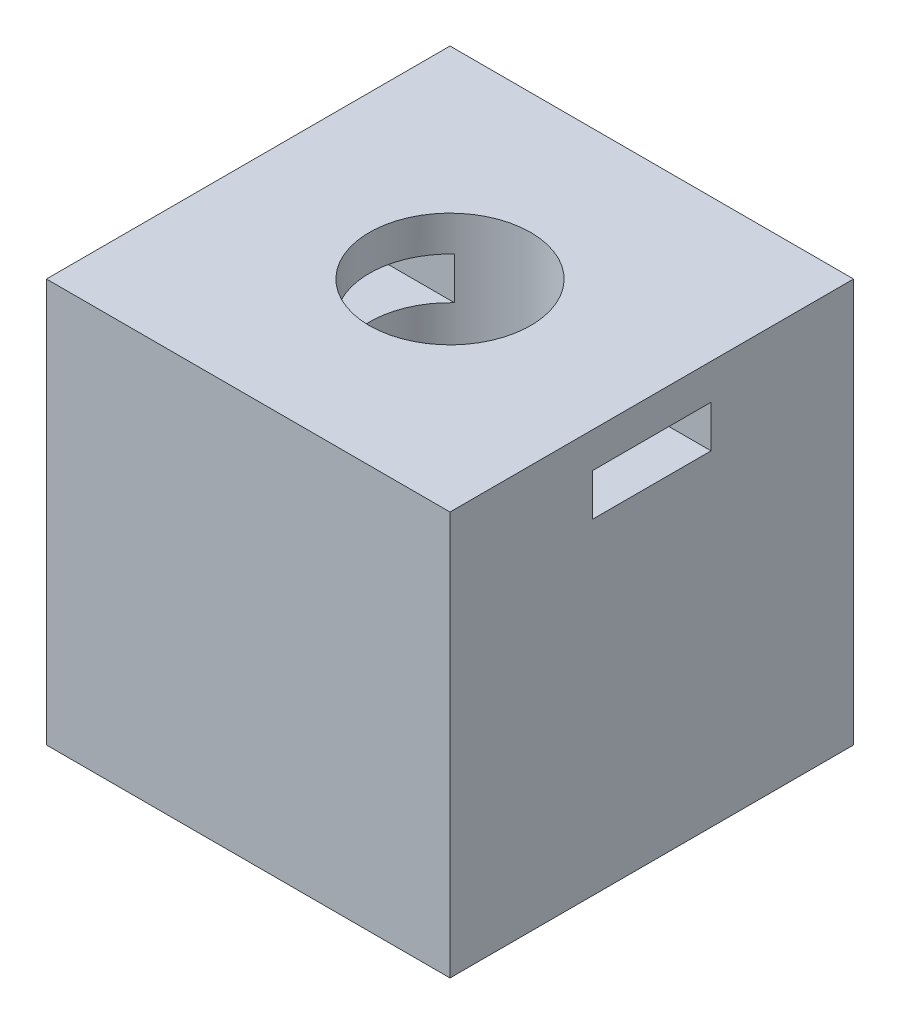
ISO-10303-21;
HEADER;
FILE_DESCRIPTION(('STEP AP214'),'2;1');
FILE_NAME('part.step','',(''),(''),'','','');
FILE_SCHEMA(('AUTOMOTIVE_DESIGN { 1 0 10303 214 1 1 1 1 }'));
ENDSEC;
DATA;
#1=APPLICATION_CONTEXT('core data for automotive mechanical design processes');
#2=APPLICATION_PROTOCOL_DEFINITION('international standard','automotive_design',2000,#1);
#3=PRODUCT_CONTEXT('',#1,'mechanical');
#4=PRODUCT('Part','Part','',(#3));
#5=PRODUCT_RELATED_PRODUCT_CATEGORY('part','',(#4));
#6=PRODUCT_DEFINITION_FORMATION('','',#4);
#7=PRODUCT_DEFINITION_CONTEXT('part definition',#1,'design');
#8=PRODUCT_DEFINITION('design','',#6,#7);
#9=PRODUCT_DEFINITION_SHAPE('','',#8);
#10=(LENGTH_UNIT() NAMED_UNIT(*) SI_UNIT(.MILLI.,.METRE.));
#11=(NAMED_UNIT(*) PLANE_ANGLE_UNIT() SI_UNIT($,.RADIAN.));
#12=(NAMED_UNIT(*) SI_UNIT($,.STERADIAN.) SOLID_ANGLE_UNIT());
#13=UNCERTAINTY_MEASURE_WITH_UNIT(LENGTH_MEASURE(1.E-05),#10,'distance_accuracy_value','');
#14=(GEOMETRIC_REPRESENTATION_CONTEXT(3) GLOBAL_UNCERTAINTY_ASSIGNED_CONTEXT((#13)) GLOBAL_UNIT_ASSIGNED_CONTEXT((#10,
#11,#12)) REPRESENTATION_CONTEXT('',''));
#15=CARTESIAN_POINT('',(0.,0.,0.));
#16=DIRECTION('',(0.,0.,1.));
#17=DIRECTION('',(1.,0.,0.));
#18=AXIS2_PLACEMENT_3D('',#15,#16,#17);
#19=CARTESIAN_POINT('',(7.49999999999999,15.,-7.5));
#20=DIRECTION('',(0.,-1.,0.));
#21=DIRECTION('',(0.,0.,-1.));
#22=AXIS2_PLACEMENT_3D('',#19,#20,#21);
#23=PLANE('',#22);
#24=DIRECTION('',(0.,0.,-1.));
#25=VECTOR('',#24,1.);
#26=CARTESIAN_POINT('',(7.49999999999999,15.,7.5));
#27=LINE('',#26,#25);
#28=CARTESIAN_POINT('',(7.49999999999999,15.,7.5));
#29=VERTEX_POINT('',#28);
#30=CARTESIAN_POINT('',(7.49999999999999,15.,-7.5));
#31=VERTEX_POINT('',#30);
#32=EDGE_CURVE('E178',#29,#31,#27,.T.);
#33=ORIENTED_EDGE('',*,*,#32,.T.);
#34=DIRECTION('',(-1.,0.,0.));
#35=VECTOR('',#34,1.);
#36=CARTESIAN_POINT('',(-7.50000000000001,15.,-7.5));
#37=LINE('',#36,#35);
#38=CARTESIAN_POINT('',(-7.50000000000001,15.,-7.5));
#39=VERTEX_POINT('',#38);
#40=EDGE_CURVE('E181',#31,#39,#37,.T.);
#41=ORIENTED_EDGE('',*,*,#40,.T.);
#42=DIRECTION('',(0.,0.,1.));
#43=VECTOR('',#42,1.);
#44=CARTESIAN_POINT('',(-7.50000000000001,15.,7.5));
#45=LINE('',#44,#43);
#46=CARTESIAN_POINT('',(-7.50000000000001,15.,7.5));
#47=VERTEX_POINT('',#46);
#48=EDGE_CURVE('E184',#39,#47,#45,.T.);
#49=ORIENTED_EDGE('',*,*,#48,.T.);
#50=DIRECTION('',(1.,0.,0.));
#51=VECTOR('',#50,1.);
#52=CARTESIAN_POINT('',(-7.50000000000001,15.,7.5));
#53=LINE('',#52,#51);
#54=EDGE_CURVE('E186',#47,#29,#53,.T.);
#55=ORIENTED_EDGE('',*,*,#54,.T.);
#56=EDGE_LOOP('',(#33,#41,#49,#55));
#57=FACE_BOUND('',#56,.T.);
#58=CARTESIAN_POINT('',(0.,15.,0.));
#59=DIRECTION('',(0.,1.,0.));
#60=DIRECTION('',(0.,0.,1.));
#61=AXIS2_PLACEMENT_3D('',#58,#59,#60);
#62=CIRCLE('',#61,3.);
#63=CARTESIAN_POINT('',(0.,15.,3.));
#64=VERTEX_POINT('',#63);
#65=EDGE_CURVE('E172',#64,#64,#62,.T.);
#66=ORIENTED_EDGE('',*,*,#65,.F.);
#67=EDGE_LOOP('',(#66));
#68=FACE_BOUND('',#67,.T.);
#69=ADVANCED_FACE('F31',(#57,#68),#23,.F.);
#70=CARTESIAN_POINT('',(7.49999999999999,0.,-7.5));
#71=DIRECTION('',(0.,-1.,0.));
#72=DIRECTION('',(0.,0.,-1.));
#73=AXIS2_PLACEMENT_3D('',#70,#71,#72);
#74=PLANE('',#73);
#75=CARTESIAN_POINT('',(-5.00000000000002,0.,0.));
#76=DIRECTION('',(0.,-1.,0.));
#77=DIRECTION('',(0.,0.,1.));
#78=AXIS2_PLACEMENT_3D('',#75,#76,#77);
#79=CIRCLE('',#78,1.5);
#80=CARTESIAN_POINT('',(-5.00000000000002,0.,1.5));
#81=VERTEX_POINT('',#80);
#82=EDGE_CURVE('E305',#81,#81,#79,.T.);
#83=ORIENTED_EDGE('',*,*,#82,.F.);
#84=EDGE_LOOP('',(#83));
#85=FACE_BOUND('',#84,.T.);
#86=CARTESIAN_POINT('',(5.,0.,0.));
#87=DIRECTION('',(0.,-1.,0.));
#88=DIRECTION('',(0.,0.,-1.));
#89=AXIS2_PLACEMENT_3D('',#86,#87,#88);
#90=CIRCLE('',#89,1.5);
#91=CARTESIAN_POINT('',(5.,0.,-1.5));
#92=VERTEX_POINT('',#91);
#93=EDGE_CURVE('E151',#92,#92,#90,.T.);
#94=ORIENTED_EDGE('',*,*,#93,.F.);
#95=EDGE_LOOP('',(#94));
#96=FACE_BOUND('',#95,.T.);
#97=DIRECTION('',(0.,0.,-1.));
#98=VECTOR('',#97,1.);
#99=CARTESIAN_POINT('',(7.49999999999999,0.,7.5));
#100=LINE('',#99,#98);
#101=CARTESIAN_POINT('',(7.49999999999999,0.,7.5));
#102=VERTEX_POINT('',#101);
#103=CARTESIAN_POINT('',(7.49999999999999,0.,-7.5));
#104=VERTEX_POINT('',#103);
#105=EDGE_CURVE('E175',#102,#104,#100,.T.);
#106=ORIENTED_EDGE('',*,*,#105,.F.);
#107=DIRECTION('',(1.,0.,0.));
#108=VECTOR('',#107,1.);
#109=CARTESIAN_POINT('',(-7.50000000000001,0.,7.5));
#110=LINE('',#109,#108);
#111=CARTESIAN_POINT('',(-7.50000000000001,0.,7.5));
#112=VERTEX_POINT('',#111);
#113=EDGE_CURVE('E182',#112,#102,#110,.T.);
#114=ORIENTED_EDGE('',*,*,#113,.F.);
#115=DIRECTION('',(0.,0.,1.));
#116=VECTOR('',#115,1.);
#117=CARTESIAN_POINT('',(-7.50000000000001,0.,7.5));
#118=LINE('',#117,#116);
#119=CARTESIAN_POINT('',(-7.50000000000001,0.,-7.5));
#120=VERTEX_POINT('',#119);
#121=EDGE_CURVE('E193',#120,#112,#118,.T.);
#122=ORIENTED_EDGE('',*,*,#121,.F.);
#123=DIRECTION('',(-1.,0.,0.));
#124=VECTOR('',#123,1.);
#125=CARTESIAN_POINT('',(-7.50000000000001,0.,-7.5));
#126=LINE('',#125,#124);
#127=EDGE_CURVE('E191',#104,#120,#126,.T.);
#128=ORIENTED_EDGE('',*,*,#127,.F.);
#129=EDGE_LOOP('',(#106,#114,#122,#128));
#130=FACE_BOUND('',#129,.T.);
#131=CARTESIAN_POINT('',(0.,0.,0.));
#132=DIRECTION('',(0.,1.,0.));
#133=DIRECTION('',(0.,0.,1.));
#134=AXIS2_PLACEMENT_3D('',#131,#132,#133);
#135=CIRCLE('',#134,3.);
#136=CARTESIAN_POINT('',(0.,0.,3.));
#137=VERTEX_POINT('',#136);
#138=EDGE_CURVE('E165',#137,#137,#135,.T.);
#139=ORIENTED_EDGE('',*,*,#138,.T.);
#140=EDGE_LOOP('',(#139));
#141=FACE_BOUND('',#140,.T.);
#142=ADVANCED_FACE('F239',(#85,#96,#130,#141),#74,.T.);
#143=CARTESIAN_POINT('',(7.49999999999999,15.,7.5));
#144=DIRECTION('',(-1.,0.,0.));
#145=DIRECTION('',(0.,0.,1.));
#146=AXIS2_PLACEMENT_3D('',#143,#144,#145);
#147=PLANE('',#146);
#148=DIRECTION('',(0.,0.,1.));
#149=VECTOR('',#148,1.);
#150=CARTESIAN_POINT('',(7.49999999999999,13.6827070410845,2.20216317837521));
#151=LINE('',#150,#149);
#152=CARTESIAN_POINT('',(7.49999999999999,13.6827070410845,-2.20216317837521));
#153=VERTEX_POINT('',#152);
#154=CARTESIAN_POINT('',(7.49999999999999,13.6827070410845,2.20216317837521));
#155=VERTEX_POINT('',#154);
#156=EDGE_CURVE('E157',#153,#155,#151,.T.);
#157=ORIENTED_EDGE('',*,*,#156,.F.);
#158=DIRECTION('',(0.,1.,0.));
#159=VECTOR('',#158,1.);
#160=CARTESIAN_POINT('',(7.49999999999999,13.6827070410845,-2.20216317837521));
#161=LINE('',#160,#159);
#162=CARTESIAN_POINT('',(7.49999999999999,12.1171011223282,-2.20216317837521));
#163=VERTEX_POINT('',#162);
#164=EDGE_CURVE('E46',#163,#153,#161,.T.);
#165=ORIENTED_EDGE('',*,*,#164,.F.);
#166=DIRECTION('',(0.,0.,-1.));
#167=VECTOR('',#166,1.);
#168=CARTESIAN_POINT('',(7.49999999999999,12.1171011223282,2.20216317837521));
#169=LINE('',#168,#167);
#170=CARTESIAN_POINT('',(7.49999999999999,12.1171011223282,2.20216317837521));
#171=VERTEX_POINT('',#170);
#172=EDGE_CURVE('E145',#171,#163,#169,.T.);
#173=ORIENTED_EDGE('',*,*,#172,.F.);
#174=DIRECTION('',(0.,-1.,0.));
#175=VECTOR('',#174,1.);
#176=CARTESIAN_POINT('',(7.49999999999999,13.6827070410845,2.20216317837521));
#177=LINE('',#176,#175);
#178=EDGE_CURVE('E148',#155,#171,#177,.T.);
#179=ORIENTED_EDGE('',*,*,#178,.F.);
#180=EDGE_LOOP('',(#157,#165,#173,#179));
#181=FACE_BOUND('',#180,.T.);
#182=ORIENTED_EDGE('',*,*,#105,.T.);
#183=DIRECTION('',(0.,-1.,0.));
#184=VECTOR('',#183,1.);
#185=CARTESIAN_POINT('',(7.49999999999999,15.,-7.5));
#186=LINE('',#185,#184);
#187=EDGE_CURVE('E204',#31,#104,#186,.T.);
#188=ORIENTED_EDGE('',*,*,#187,.F.);
#189=ORIENTED_EDGE('',*,*,#32,.F.);
#190=DIRECTION('',(0.,-1.,0.));
#191=VECTOR('',#190,1.);
#192=CARTESIAN_POINT('',(7.49999999999999,15.,7.5));
#193=LINE('',#192,#191);
#194=EDGE_CURVE('E188',#29,#102,#193,.T.);
#195=ORIENTED_EDGE('',*,*,#194,.T.);
#196=EDGE_LOOP('',(#182,#188,#189,#195));
#197=FACE_BOUND('',#196,.T.);
#198=ADVANCED_FACE('F33',(#181,#197),#147,.F.);
#199=CARTESIAN_POINT('',(-7.50000000000001,15.,-7.5));
#200=DIRECTION('',(0.,0.,1.));
#201=DIRECTION('',(1.,0.,0.));
#202=AXIS2_PLACEMENT_3D('',#199,#200,#201);
#203=PLANE('',#202);
#204=ORIENTED_EDGE('',*,*,#127,.T.);
#205=DIRECTION('',(0.,-1.,0.));
#206=VECTOR('',#205,1.);
#207=CARTESIAN_POINT('',(-7.50000000000001,15.,-7.5));
#208=LINE('',#207,#206);
#209=EDGE_CURVE('E201',#39,#120,#208,.T.);
#210=ORIENTED_EDGE('',*,*,#209,.F.);
#211=ORIENTED_EDGE('',*,*,#40,.F.);
#212=ORIENTED_EDGE('',*,*,#187,.T.);
#213=EDGE_LOOP('',(#204,#210,#211,#212));
#214=FACE_BOUND('',#213,.T.);
#215=ADVANCED_FACE('F238',(#214),#203,.F.);
#216=CARTESIAN_POINT('',(-7.50000000000001,15.,7.5));
#217=DIRECTION('',(1.,0.,0.));
#218=DIRECTION('',(0.,0.,-1.));
#219=AXIS2_PLACEMENT_3D('',#216,#217,#218);
#220=PLANE('',#219);
#221=DIRECTION('',(0.,0.,-1.));
#222=VECTOR('',#221,1.);
#223=CARTESIAN_POINT('',(-7.50000000000001,12.1171011223282,2.20216317837521));
#224=LINE('',#223,#222);
#225=CARTESIAN_POINT('',(-7.50000000000001,12.1171011223282,2.20216317837521));
#226=VERTEX_POINT('',#225);
#227=CARTESIAN_POINT('',(-7.50000000000001,12.1171011223282,-2.20216317837521));
#228=VERTEX_POINT('',#227);
#229=EDGE_CURVE('E144',#226,#228,#224,.T.);
#230=ORIENTED_EDGE('',*,*,#229,.T.);
#231=DIRECTION('',(0.,1.,0.));
#232=VECTOR('',#231,1.);
#233=CARTESIAN_POINT('',(-7.50000000000001,13.6827070410845,-2.20216317837521));
#234=LINE('',#233,#232);
#235=CARTESIAN_POINT('',(-7.50000000000001,13.6827070410845,-2.20216317837521));
#236=VERTEX_POINT('',#235);
#237=EDGE_CURVE('E126',#228,#236,#234,.T.);
#238=ORIENTED_EDGE('',*,*,#237,.T.);
#239=DIRECTION('',(0.,0.,1.));
#240=VECTOR('',#239,1.);
#241=CARTESIAN_POINT('',(-7.50000000000001,13.6827070410845,2.20216317837521));
#242=LINE('',#241,#240);
#243=CARTESIAN_POINT('',(-7.50000000000001,13.6827070410845,2.20216317837521));
#244=VERTEX_POINT('',#243);
#245=EDGE_CURVE('E136',#236,#244,#242,.T.);
#246=ORIENTED_EDGE('',*,*,#245,.T.);
#247=DIRECTION('',(0.,-1.,0.));
#248=VECTOR('',#247,1.);
#249=CARTESIAN_POINT('',(-7.50000000000001,13.6827070410845,2.20216317837521));
#250=LINE('',#249,#248);
#251=EDGE_CURVE('E54',#244,#226,#250,.T.);
#252=ORIENTED_EDGE('',*,*,#251,.T.);
#253=EDGE_LOOP('',(#230,#238,#246,#252));
#254=FACE_BOUND('',#253,.T.);
#255=ORIENTED_EDGE('',*,*,#121,.T.);
#256=DIRECTION('',(0.,-1.,0.));
#257=VECTOR('',#256,1.);
#258=CARTESIAN_POINT('',(-7.50000000000001,15.,7.5));
#259=LINE('',#258,#257);
#260=EDGE_CURVE('E198',#47,#112,#259,.T.);
#261=ORIENTED_EDGE('',*,*,#260,.F.);
#262=ORIENTED_EDGE('',*,*,#48,.F.);
#263=ORIENTED_EDGE('',*,*,#209,.T.);
#264=EDGE_LOOP('',(#255,#261,#262,#263));
#265=FACE_BOUND('',#264,.T.);
#266=ADVANCED_FACE('F141',(#254,#265),#220,.F.);
#267=CARTESIAN_POINT('',(-7.50000000000001,15.,7.5));
#268=DIRECTION('',(0.,0.,-1.));
#269=DIRECTION('',(-1.,0.,0.));
#270=AXIS2_PLACEMENT_3D('',#267,#268,#269);
#271=PLANE('',#270);
#272=ORIENTED_EDGE('',*,*,#113,.T.);
#273=ORIENTED_EDGE('',*,*,#194,.F.);
#274=ORIENTED_EDGE('',*,*,#54,.F.);
#275=ORIENTED_EDGE('',*,*,#260,.T.);
#276=EDGE_LOOP('',(#272,#273,#274,#275));
#277=FACE_BOUND('',#276,.T.);
#278=ADVANCED_FACE('F256',(#277),#271,.F.);
#279=CARTESIAN_POINT('',(0.,15.,0.));
#280=DIRECTION('',(0.,-1.,0.));
#281=DIRECTION('',(0.,0.,-1.));
#282=AXIS2_PLACEMENT_3D('',#279,#280,#281);
#283=CYLINDRICAL_SURFACE('',#282,3.);
#284=DIRECTION('',(0.,-1.,0.));
#285=VECTOR('',#284,1.);
#286=CARTESIAN_POINT('',(2.03727203284401,15.,-2.20216317837521));
#287=LINE('',#286,#285);
#288=CARTESIAN_POINT('',(2.03727203284401,13.6827070410845,-2.20216317837521));
#289=VERTEX_POINT('',#288);
#290=CARTESIAN_POINT('',(2.03727203284401,12.1171011223282,-2.20216317837521));
#291=VERTEX_POINT('',#290);
#292=EDGE_CURVE('E11',#289,#291,#287,.T.);
#293=ORIENTED_EDGE('',*,*,#292,.F.);
#294=CARTESIAN_POINT('',(0.,13.6827070410845,0.));
#295=DIRECTION('',(0.,1.,0.));
#296=DIRECTION('',(0.,0.,1.));
#297=AXIS2_PLACEMENT_3D('',#294,#295,#296);
#298=CIRCLE('',#297,3.);
#299=CARTESIAN_POINT('',(2.03727203284401,13.6827070410845,2.20216317837521));
#300=VERTEX_POINT('',#299);
#301=EDGE_CURVE('E210',#300,#289,#298,.T.);
#302=ORIENTED_EDGE('',*,*,#301,.F.);
#303=DIRECTION('',(0.,-1.,0.));
#304=VECTOR('',#303,1.);
#305=CARTESIAN_POINT('',(2.03727203284401,15.,2.20216317837521));
#306=LINE('',#305,#304);
#307=CARTESIAN_POINT('',(2.03727203284401,12.1171011223282,2.20216317837521));
#308=VERTEX_POINT('',#307);
#309=EDGE_CURVE('E214',#308,#300,#306,.F.);
#310=ORIENTED_EDGE('',*,*,#309,.F.);
#311=CARTESIAN_POINT('',(0.,12.1171011223282,0.));
#312=DIRECTION('',(0.,-1.,0.));
#313=DIRECTION('',(0.,0.,-1.));
#314=AXIS2_PLACEMENT_3D('',#311,#312,#313);
#315=CIRCLE('',#314,3.);
#316=EDGE_CURVE('E39',#291,#308,#315,.T.);
#317=ORIENTED_EDGE('',*,*,#316,.F.);
#318=EDGE_LOOP('',(#293,#302,#310,#317));
#319=FACE_BOUND('',#318,.T.);
#320=DIRECTION('',(0.,-1.,0.));
#321=VECTOR('',#320,1.);
#322=CARTESIAN_POINT('',(-2.03727203284403,15.,-2.20216317837521));
#323=LINE('',#322,#321);
#324=CARTESIAN_POINT('',(-2.03727203284403,12.1171011223282,-2.20216317837521));
#325=VERTEX_POINT('',#324);
#326=CARTESIAN_POINT('',(-2.03727203284403,13.6827070410845,-2.20216317837521));
#327=VERTEX_POINT('',#326);
#328=EDGE_CURVE('E129',#325,#327,#323,.F.);
#329=ORIENTED_EDGE('',*,*,#328,.F.);
#330=CARTESIAN_POINT('',(-2.03727203284403,12.1171011223282,2.20216317837521));
#331=VERTEX_POINT('',#330);
#332=EDGE_CURVE('E212',#331,#325,#315,.T.);
#333=ORIENTED_EDGE('',*,*,#332,.F.);
#334=DIRECTION('',(0.,-1.,0.));
#335=VECTOR('',#334,1.);
#336=CARTESIAN_POINT('',(-2.03727203284403,15.,2.20216317837521));
#337=LINE('',#336,#335);
#338=CARTESIAN_POINT('',(-2.03727203284403,13.6827070410845,2.20216317837521));
#339=VERTEX_POINT('',#338);
#340=EDGE_CURVE('E209',#339,#331,#337,.T.);
#341=ORIENTED_EDGE('',*,*,#340,.F.);
#342=EDGE_CURVE('E207',#327,#339,#298,.T.);
#343=ORIENTED_EDGE('',*,*,#342,.F.);
#344=EDGE_LOOP('',(#329,#333,#341,#343));
#345=FACE_BOUND('',#344,.T.);
#346=ORIENTED_EDGE('',*,*,#65,.T.);
#347=EDGE_LOOP('',(#346));
#348=FACE_BOUND('',#347,.T.);
#349=ORIENTED_EDGE('',*,*,#138,.F.);
#350=EDGE_LOOP('',(#349));
#351=FACE_BOUND('',#350,.T.);
#352=ADVANCED_FACE('F228',(#319,#345,#348,#351),#283,.F.);
#353=CARTESIAN_POINT('',(-7.50000000000001,13.6827070410845,2.20216317837521));
#354=DIRECTION('',(0.,1.,0.));
#355=DIRECTION('',(0.,0.,1.));
#356=AXIS2_PLACEMENT_3D('',#353,#354,#355);
#357=PLANE('',#356);
#358=ORIENTED_EDGE('',*,*,#342,.T.);
#359=DIRECTION('',(1.,0.,0.));
#360=VECTOR('',#359,1.);
#361=CARTESIAN_POINT('',(-7.50000000000001,13.6827070410845,2.20216317837521));
#362=LINE('',#361,#360);
#363=EDGE_CURVE('E138',#244,#339,#362,.T.);
#364=ORIENTED_EDGE('',*,*,#363,.F.);
#365=ORIENTED_EDGE('',*,*,#245,.F.);
#366=DIRECTION('',(1.,0.,0.));
#367=VECTOR('',#366,1.);
#368=CARTESIAN_POINT('',(-7.50000000000001,13.6827070410845,-2.20216317837521));
#369=LINE('',#368,#367);
#370=EDGE_CURVE('E121',#236,#327,#369,.T.);
#371=ORIENTED_EDGE('',*,*,#370,.T.);
#372=EDGE_LOOP('',(#358,#364,#365,#371));
#373=FACE_BOUND('',#372,.T.);
#374=ADVANCED_FACE('F137',(#373),#357,.F.);
#375=CARTESIAN_POINT('',(-7.50000000000001,13.6827070410845,2.20216317837521));
#376=DIRECTION('',(0.,0.,1.));
#377=DIRECTION('',(1.,0.,0.));
#378=AXIS2_PLACEMENT_3D('',#375,#376,#377);
#379=PLANE('',#378);
#380=ORIENTED_EDGE('',*,*,#340,.T.);
#381=DIRECTION('',(1.,0.,0.));
#382=VECTOR('',#381,1.);
#383=CARTESIAN_POINT('',(-7.50000000000001,12.1171011223282,2.20216317837521));
#384=LINE('',#383,#382);
#385=EDGE_CURVE('E167',#226,#331,#384,.T.);
#386=ORIENTED_EDGE('',*,*,#385,.F.);
#387=ORIENTED_EDGE('',*,*,#251,.F.);
#388=ORIENTED_EDGE('',*,*,#363,.T.);
#389=EDGE_LOOP('',(#380,#386,#387,#388));
#390=FACE_BOUND('',#389,.T.);
#391=ADVANCED_FACE('F279',(#390),#379,.F.);
#392=CARTESIAN_POINT('',(-7.50000000000001,12.1171011223282,2.20216317837521));
#393=DIRECTION('',(0.,-1.,0.));
#394=DIRECTION('',(0.,0.,-1.));
#395=AXIS2_PLACEMENT_3D('',#392,#393,#394);
#396=PLANE('',#395);
#397=ORIENTED_EDGE('',*,*,#332,.T.);
#398=DIRECTION('',(1.,0.,0.));
#399=VECTOR('',#398,1.);
#400=CARTESIAN_POINT('',(-7.50000000000001,12.1171011223282,-2.20216317837521));
#401=LINE('',#400,#399);
#402=EDGE_CURVE('E163',#228,#325,#401,.T.);
#403=ORIENTED_EDGE('',*,*,#402,.F.);
#404=ORIENTED_EDGE('',*,*,#229,.F.);
#405=ORIENTED_EDGE('',*,*,#385,.T.);
#406=EDGE_LOOP('',(#397,#403,#404,#405));
#407=FACE_BOUND('',#406,.T.);
#408=ADVANCED_FACE('F276',(#407),#396,.F.);
#409=CARTESIAN_POINT('',(-7.50000000000001,13.6827070410845,-2.20216317837521));
#410=DIRECTION('',(0.,0.,-1.));
#411=DIRECTION('',(-1.,0.,0.));
#412=AXIS2_PLACEMENT_3D('',#409,#410,#411);
#413=PLANE('',#412);
#414=ORIENTED_EDGE('',*,*,#328,.T.);
#415=ORIENTED_EDGE('',*,*,#370,.F.);
#416=ORIENTED_EDGE('',*,*,#237,.F.);
#417=ORIENTED_EDGE('',*,*,#402,.T.);
#418=EDGE_LOOP('',(#414,#415,#416,#417));
#419=FACE_BOUND('',#418,.T.);
#420=ADVANCED_FACE('F123',(#419),#413,.F.);
#421=ORIENTED_EDGE('',*,*,#292,.T.);
#422=EDGE_CURVE('E166',#291,#163,#401,.T.);
#423=ORIENTED_EDGE('',*,*,#422,.T.);
#424=ORIENTED_EDGE('',*,*,#164,.T.);
#425=EDGE_CURVE('E133',#289,#153,#369,.T.);
#426=ORIENTED_EDGE('',*,*,#425,.F.);
#427=EDGE_LOOP('',(#421,#423,#424,#426));
#428=FACE_BOUND('',#427,.T.);
#429=ADVANCED_FACE('F225',(#428),#413,.F.);
#430=ORIENTED_EDGE('',*,*,#316,.T.);
#431=EDGE_CURVE('E170',#308,#171,#384,.T.);
#432=ORIENTED_EDGE('',*,*,#431,.T.);
#433=ORIENTED_EDGE('',*,*,#172,.T.);
#434=ORIENTED_EDGE('',*,*,#422,.F.);
#435=EDGE_LOOP('',(#430,#432,#433,#434));
#436=FACE_BOUND('',#435,.T.);
#437=ADVANCED_FACE('F231',(#436),#396,.F.);
#438=ORIENTED_EDGE('',*,*,#301,.T.);
#439=ORIENTED_EDGE('',*,*,#425,.T.);
#440=ORIENTED_EDGE('',*,*,#156,.T.);
#441=EDGE_CURVE('E132',#300,#155,#362,.T.);
#442=ORIENTED_EDGE('',*,*,#441,.F.);
#443=EDGE_LOOP('',(#438,#439,#440,#442));
#444=FACE_BOUND('',#443,.T.);
#445=ADVANCED_FACE('F221',(#444),#357,.F.);
#446=ORIENTED_EDGE('',*,*,#309,.T.);
#447=ORIENTED_EDGE('',*,*,#441,.T.);
#448=ORIENTED_EDGE('',*,*,#178,.T.);
#449=ORIENTED_EDGE('',*,*,#431,.F.);
#450=EDGE_LOOP('',(#446,#447,#448,#449));
#451=FACE_BOUND('',#450,.T.);
#452=ADVANCED_FACE('F232',(#451),#379,.F.);
#453=CARTESIAN_POINT('',(5.,10.,0.));
#454=DIRECTION('',(0.,-1.,0.));
#455=DIRECTION('',(0.,0.,-1.));
#456=AXIS2_PLACEMENT_3D('',#453,#454,#455);
#457=CYLINDRICAL_SURFACE('',#456,1.5);
#458=CARTESIAN_POINT('',(5.,10.,0.));
#459=DIRECTION('',(0.,-1.,0.));
#460=DIRECTION('',(0.,0.,-1.));
#461=AXIS2_PLACEMENT_3D('',#458,#459,#460);
#462=CIRCLE('',#461,1.5);
#463=CARTESIAN_POINT('',(5.,10.,-1.5));
#464=VERTEX_POINT('',#463);
#465=EDGE_CURVE('E158',#464,#464,#462,.T.);
#466=ORIENTED_EDGE('',*,*,#465,.F.);
#467=EDGE_LOOP('',(#466));
#468=FACE_BOUND('',#467,.T.);
#469=ORIENTED_EDGE('',*,*,#93,.T.);
#470=EDGE_LOOP('',(#469));
#471=FACE_BOUND('',#470,.T.);
#472=ADVANCED_FACE('F282',(#468,#471),#457,.F.);
#473=CARTESIAN_POINT('',(5.,10.,0.));
#474=DIRECTION('',(0.,-1.,0.));
#475=DIRECTION('',(0.,0.,-1.));
#476=AXIS2_PLACEMENT_3D('',#473,#474,#475);
#477=PLANE('',#476);
#478=ORIENTED_EDGE('',*,*,#465,.T.);
#479=EDGE_LOOP('',(#478));
#480=FACE_BOUND('',#479,.T.);
#481=ADVANCED_FACE('F288',(#480),#477,.T.);
#482=CARTESIAN_POINT('',(-5.00000000000002,10.,0.));
#483=DIRECTION('',(0.,-1.,0.));
#484=DIRECTION('',(0.,0.,-1.));
#485=AXIS2_PLACEMENT_3D('',#482,#483,#484);
#486=CYLINDRICAL_SURFACE('',#485,1.5);
#487=CARTESIAN_POINT('',(-5.00000000000002,10.,0.));
#488=DIRECTION('',(0.,-1.,0.));
#489=DIRECTION('',(0.,0.,1.));
#490=AXIS2_PLACEMENT_3D('',#487,#488,#489);
#491=CIRCLE('',#490,1.5);
#492=CARTESIAN_POINT('',(-5.00000000000002,10.,1.5));
#493=VERTEX_POINT('',#492);
#494=EDGE_CURVE('E304',#493,#493,#491,.T.);
#495=ORIENTED_EDGE('',*,*,#494,.F.);
#496=EDGE_LOOP('',(#495));
#497=FACE_BOUND('',#496,.T.);
#498=ORIENTED_EDGE('',*,*,#82,.T.);
#499=EDGE_LOOP('',(#498));
#500=FACE_BOUND('',#499,.T.);
#501=ADVANCED_FACE('F292',(#497,#500),#486,.F.);
#502=CARTESIAN_POINT('',(-5.00000000000002,10.,0.));
#503=DIRECTION('',(0.,1.,0.));
#504=DIRECTION('',(0.,0.,1.));
#505=AXIS2_PLACEMENT_3D('',#502,#503,#504);
#506=PLANE('',#505);
#507=ORIENTED_EDGE('',*,*,#494,.T.);
#508=EDGE_LOOP('',(#507));
#509=FACE_BOUND('',#508,.T.);
#510=ADVANCED_FACE('F296',(#509),#506,.F.);
#511=CLOSED_SHELL('',(#69,#142,#198,#215,#266,#278,#352,#374,#391,#408,#420,#429,#437,#445,#452,
#472,#481,#501,#510));
#512=MANIFOLD_SOLID_BREP('B2',#511);
#513=ADVANCED_BREP_SHAPE_REPRESENTATION('',(#18,#512),#14);
#514=SHAPE_DEFINITION_REPRESENTATION(#9,#513);
ENDSEC;
END-ISO-10303-21;
